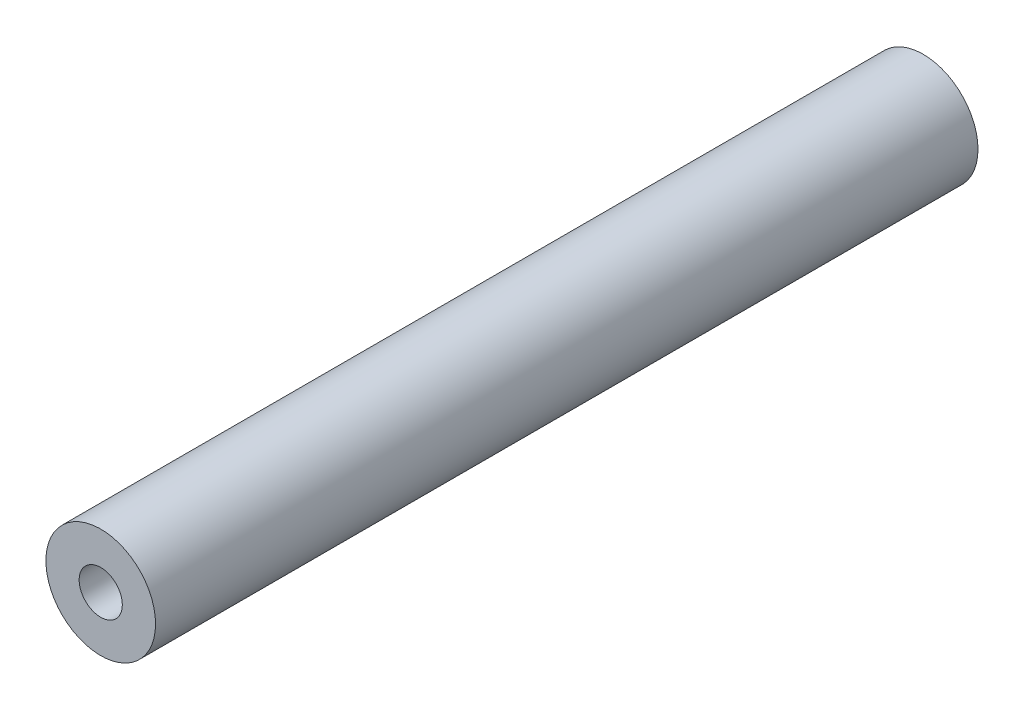
ISO-10303-21;
HEADER;
FILE_DESCRIPTION(('STEP AP214'),'2;1');
FILE_NAME('part.step','',(''),(''),'','','');
FILE_SCHEMA(('AUTOMOTIVE_DESIGN { 1 0 10303 214 1 1 1 1 }'));
ENDSEC;
DATA;
#1=APPLICATION_CONTEXT('core data for automotive mechanical design processes');
#2=APPLICATION_PROTOCOL_DEFINITION('international standard','automotive_design',2000,#1);
#3=PRODUCT_CONTEXT('',#1,'mechanical');
#4=PRODUCT('Part','Part','',(#3));
#5=PRODUCT_RELATED_PRODUCT_CATEGORY('part','',(#4));
#6=PRODUCT_DEFINITION_FORMATION('','',#4);
#7=PRODUCT_DEFINITION_CONTEXT('part definition',#1,'design');
#8=PRODUCT_DEFINITION('design','',#6,#7);
#9=PRODUCT_DEFINITION_SHAPE('','',#8);
#10=(LENGTH_UNIT() NAMED_UNIT(*) SI_UNIT(.MILLI.,.METRE.));
#11=(NAMED_UNIT(*) PLANE_ANGLE_UNIT() SI_UNIT($,.RADIAN.));
#12=(NAMED_UNIT(*) SI_UNIT($,.STERADIAN.) SOLID_ANGLE_UNIT());
#13=UNCERTAINTY_MEASURE_WITH_UNIT(LENGTH_MEASURE(1.E-05),#10,'distance_accuracy_value','');
#14=(GEOMETRIC_REPRESENTATION_CONTEXT(3) GLOBAL_UNCERTAINTY_ASSIGNED_CONTEXT((#13)) GLOBAL_UNIT_ASSIGNED_CONTEXT((#10,
#11,#12)) REPRESENTATION_CONTEXT('',''));
#15=CARTESIAN_POINT('',(0.,0.,0.));
#16=DIRECTION('',(0.,0.,1.));
#17=DIRECTION('',(1.,0.,0.));
#18=AXIS2_PLACEMENT_3D('',#15,#16,#17);
#19=CARTESIAN_POINT('',(53.780969953537,-135.449923089186,10.25));
#20=DIRECTION('',(0.,0.,1.));
#21=DIRECTION('',(1.,0.,0.));
#22=AXIS2_PLACEMENT_3D('',#19,#20,#21);
#23=CYLINDRICAL_SURFACE('',#22,2.5400000000002);
#24=CARTESIAN_POINT('',(53.780969953537,-135.449923089186,10.25));
#25=DIRECTION('',(0.,0.,1.));
#26=DIRECTION('',(1.,0.,0.));
#27=AXIS2_PLACEMENT_3D('',#24,#25,#26);
#28=CIRCLE('',#27,2.5400000000002);
#29=CARTESIAN_POINT('',(56.3209699535372,-135.449923089186,10.25));
#30=VERTEX_POINT('',#29);
#31=EDGE_CURVE('E10',#30,#30,#28,.T.);
#32=ORIENTED_EDGE('',*,*,#31,.T.);
#33=EDGE_LOOP('',(#32));
#34=FACE_BOUND('',#33,.T.);
#35=CARTESIAN_POINT('',(53.780969953537,-135.449923089186,48.35));
#36=DIRECTION('',(0.,0.,1.));
#37=DIRECTION('',(1.,0.,0.));
#38=AXIS2_PLACEMENT_3D('',#35,#36,#37);
#39=CIRCLE('',#38,2.5400000000002);
#40=CARTESIAN_POINT('',(56.3209699535372,-135.449923089186,48.35));
#41=VERTEX_POINT('',#40);
#42=EDGE_CURVE('E38',#41,#41,#39,.T.);
#43=ORIENTED_EDGE('',*,*,#42,.F.);
#44=EDGE_LOOP('',(#43));
#45=FACE_BOUND('',#44,.T.);
#46=ADVANCED_FACE('F35',(#34,#45),#23,.T.);
#47=CARTESIAN_POINT('',(53.780969953537,-135.449923089186,10.25));
#48=DIRECTION('',(0.,0.,1.));
#49=DIRECTION('',(1.,0.,0.));
#50=AXIS2_PLACEMENT_3D('',#47,#48,#49);
#51=PLANE('',#50);
#52=CARTESIAN_POINT('',(53.780969953537,-135.449923089186,10.25));
#53=DIRECTION('',(0.,0.,1.));
#54=DIRECTION('',(1.,0.,0.));
#55=AXIS2_PLACEMENT_3D('',#52,#53,#54);
#56=CIRCLE('',#55,0.99999999999981);
#57=CARTESIAN_POINT('',(54.7809699535368,-135.449923089186,10.25));
#58=VERTEX_POINT('',#57);
#59=EDGE_CURVE('E45',#58,#58,#56,.T.);
#60=ORIENTED_EDGE('',*,*,#59,.T.);
#61=EDGE_LOOP('',(#60));
#62=FACE_BOUND('',#61,.T.);
#63=ORIENTED_EDGE('',*,*,#31,.F.);
#64=EDGE_LOOP('',(#63));
#65=FACE_BOUND('',#64,.T.);
#66=ADVANCED_FACE('F53',(#62,#65),#51,.F.);
#67=CARTESIAN_POINT('',(53.780969953537,-135.449923089186,48.35));
#68=DIRECTION('',(0.,0.,1.));
#69=DIRECTION('',(1.,0.,0.));
#70=AXIS2_PLACEMENT_3D('',#67,#68,#69);
#71=PLANE('',#70);
#72=CARTESIAN_POINT('',(53.780969953537,-135.449923089186,48.35));
#73=DIRECTION('',(0.,0.,1.));
#74=DIRECTION('',(1.,0.,0.));
#75=AXIS2_PLACEMENT_3D('',#72,#73,#74);
#76=CIRCLE('',#75,0.99999999999981);
#77=CARTESIAN_POINT('',(54.7809699535368,-135.449923089186,48.35));
#78=VERTEX_POINT('',#77);
#79=EDGE_CURVE('E47',#78,#78,#76,.T.);
#80=ORIENTED_EDGE('',*,*,#79,.F.);
#81=EDGE_LOOP('',(#80));
#82=FACE_BOUND('',#81,.T.);
#83=ORIENTED_EDGE('',*,*,#42,.T.);
#84=EDGE_LOOP('',(#83));
#85=FACE_BOUND('',#84,.T.);
#86=ADVANCED_FACE('F59',(#82,#85),#71,.T.);
#87=CARTESIAN_POINT('',(53.780969953537,-135.449923089186,10.25));
#88=DIRECTION('',(0.,0.,1.));
#89=DIRECTION('',(1.,0.,0.));
#90=AXIS2_PLACEMENT_3D('',#87,#88,#89);
#91=CYLINDRICAL_SURFACE('',#90,0.99999999999981);
#92=ORIENTED_EDGE('',*,*,#59,.F.);
#93=EDGE_LOOP('',(#92));
#94=FACE_BOUND('',#93,.T.);
#95=ORIENTED_EDGE('',*,*,#79,.T.);
#96=EDGE_LOOP('',(#95));
#97=FACE_BOUND('',#96,.T.);
#98=ADVANCED_FACE('F56',(#94,#97),#91,.F.);
#99=CLOSED_SHELL('',(#46,#66,#86,#98));
#100=MANIFOLD_SOLID_BREP('B2',#99);
#101=ADVANCED_BREP_SHAPE_REPRESENTATION('',(#18,#100),#14);
#102=SHAPE_DEFINITION_REPRESENTATION(#9,#101);
ENDSEC;
END-ISO-10303-21;
